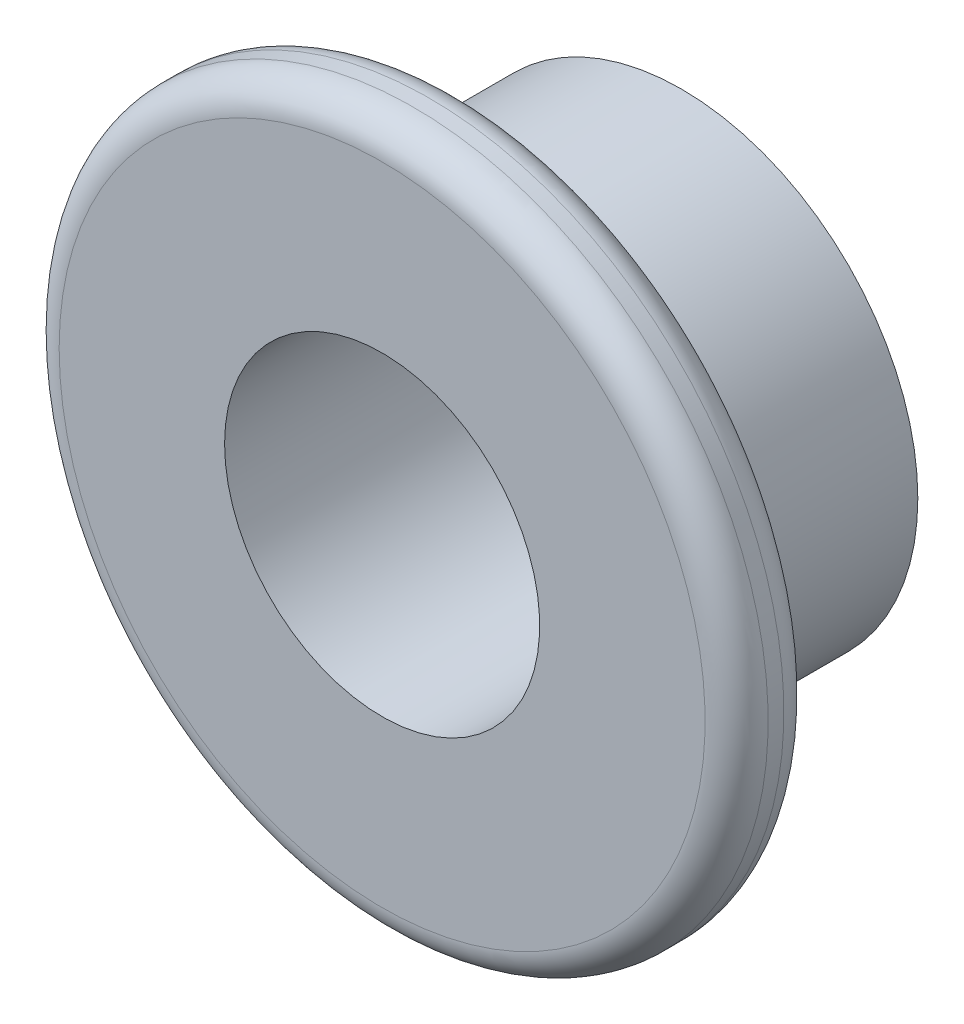
ISO-10303-21;
HEADER;
FILE_DESCRIPTION(('STEP AP214'),'2;1');
FILE_NAME('part.step','',(''),(''),'','','');
FILE_SCHEMA(('AUTOMOTIVE_DESIGN { 1 0 10303 214 1 1 1 1 }'));
ENDSEC;
DATA;
#1=APPLICATION_CONTEXT('core data for automotive mechanical design processes');
#2=APPLICATION_PROTOCOL_DEFINITION('international standard','automotive_design',2000,#1);
#3=PRODUCT_CONTEXT('',#1,'mechanical');
#4=PRODUCT('Part','Part','',(#3));
#5=PRODUCT_RELATED_PRODUCT_CATEGORY('part','',(#4));
#6=PRODUCT_DEFINITION_FORMATION('','',#4);
#7=PRODUCT_DEFINITION_CONTEXT('part definition',#1,'design');
#8=PRODUCT_DEFINITION('design','',#6,#7);
#9=PRODUCT_DEFINITION_SHAPE('','',#8);
#10=(LENGTH_UNIT() NAMED_UNIT(*) SI_UNIT(.MILLI.,.METRE.));
#11=(NAMED_UNIT(*) PLANE_ANGLE_UNIT() SI_UNIT($,.RADIAN.));
#12=(NAMED_UNIT(*) SI_UNIT($,.STERADIAN.) SOLID_ANGLE_UNIT());
#13=UNCERTAINTY_MEASURE_WITH_UNIT(LENGTH_MEASURE(1.E-05),#10,'distance_accuracy_value','');
#14=(GEOMETRIC_REPRESENTATION_CONTEXT(3) GLOBAL_UNCERTAINTY_ASSIGNED_CONTEXT((#13)) GLOBAL_UNIT_ASSIGNED_CONTEXT((#10,
#11,#12)) REPRESENTATION_CONTEXT('',''));
#15=CARTESIAN_POINT('',(0.,0.,0.));
#16=DIRECTION('',(0.,0.,1.));
#17=DIRECTION('',(1.,0.,0.));
#18=AXIS2_PLACEMENT_3D('',#15,#16,#17);
#19=CARTESIAN_POINT('',(0.,0.,5.5));
#20=DIRECTION('',(0.,0.,1.));
#21=DIRECTION('',(1.,0.,0.));
#22=AXIS2_PLACEMENT_3D('',#19,#20,#21);
#23=CYLINDRICAL_SURFACE('',#22,3.);
#24=CARTESIAN_POINT('',(0.,0.,6.3));
#25=DIRECTION('',(0.,0.,1.));
#26=DIRECTION('',(1.,0.,0.));
#27=AXIS2_PLACEMENT_3D('',#24,#25,#26);
#28=CIRCLE('',#27,3.);
#29=CARTESIAN_POINT('',(-2.99999999999994,0.,6.3));
#30=VERTEX_POINT('',#29);
#31=EDGE_CURVE('E69',#30,#30,#28,.T.);
#32=ORIENTED_EDGE('',*,*,#31,.F.);
#33=DIRECTION('',(0.,0.,-1.));
#34=VECTOR('',#33,1.);
#35=CARTESIAN_POINT('',(-2.99999999999994,0.,5.5));
#36=LINE('',#35,#34);
#37=CARTESIAN_POINT('',(-3.,0.,3.5));
#38=VERTEX_POINT('',#37);
#39=EDGE_CURVE('E11',#30,#38,#36,.T.);
#40=ORIENTED_EDGE('',*,*,#39,.T.);
#41=CARTESIAN_POINT('',(0.,0.,3.5));
#42=DIRECTION('',(0.,0.,-1.));
#43=DIRECTION('',(1.,0.,0.));
#44=AXIS2_PLACEMENT_3D('',#41,#42,#43);
#45=CIRCLE('',#44,3.);
#46=EDGE_CURVE('E68',#38,#38,#45,.T.);
#47=ORIENTED_EDGE('',*,*,#46,.F.);
#48=ORIENTED_EDGE('',*,*,#39,.F.);
#49=EDGE_LOOP('',(#32,#40,#47,#48));
#50=FACE_BOUND('',#49,.T.);
#51=ADVANCED_FACE('F16',(#50),#23,.T.);
#52=CARTESIAN_POINT('',(0.,0.,5.5));
#53=DIRECTION('',(0.,0.,1.));
#54=DIRECTION('',(1.,0.,0.));
#55=AXIS2_PLACEMENT_3D('',#52,#53,#54);
#56=CYLINDRICAL_SURFACE('',#55,2.);
#57=CARTESIAN_POINT('',(0.,0.,7.3));
#58=DIRECTION('',(0.,0.,-1.));
#59=DIRECTION('',(1.,0.,0.));
#60=AXIS2_PLACEMENT_3D('',#57,#58,#59);
#61=CIRCLE('',#60,2.);
#62=CARTESIAN_POINT('',(-1.99999999999994,0.,7.3));
#63=VERTEX_POINT('',#62);
#64=EDGE_CURVE('E102',#63,#63,#61,.T.);
#65=ORIENTED_EDGE('',*,*,#64,.F.);
#66=DIRECTION('',(0.,0.,-1.));
#67=VECTOR('',#66,1.);
#68=CARTESIAN_POINT('',(-1.99999999999996,0.,5.5));
#69=LINE('',#68,#67);
#70=CARTESIAN_POINT('',(-2.,0.,3.5));
#71=VERTEX_POINT('',#70);
#72=EDGE_CURVE('E19',#63,#71,#69,.T.);
#73=ORIENTED_EDGE('',*,*,#72,.T.);
#74=CARTESIAN_POINT('',(0.,0.,3.5));
#75=DIRECTION('',(0.,0.,1.));
#76=DIRECTION('',(1.,0.,0.));
#77=AXIS2_PLACEMENT_3D('',#74,#75,#76);
#78=CIRCLE('',#77,2.);
#79=EDGE_CURVE('E73',#71,#71,#78,.T.);
#80=ORIENTED_EDGE('',*,*,#79,.F.);
#81=ORIENTED_EDGE('',*,*,#72,.F.);
#82=EDGE_LOOP('',(#65,#73,#80,#81));
#83=FACE_BOUND('',#82,.T.);
#84=ADVANCED_FACE('F167',(#83),#56,.F.);
#85=CARTESIAN_POINT('',(0.,0.,6.3));
#86=DIRECTION('',(0.,0.,1.));
#87=DIRECTION('',(1.,0.,0.));
#88=AXIS2_PLACEMENT_3D('',#85,#86,#87);
#89=PLANE('',#88);
#90=ORIENTED_EDGE('',*,*,#31,.T.);
#91=EDGE_LOOP('',(#90));
#92=FACE_BOUND('',#91,.T.);
#93=CARTESIAN_POINT('',(0.,0.,6.3));
#94=DIRECTION('',(0.,0.,1.));
#95=DIRECTION('',(1.,0.,0.));
#96=AXIS2_PLACEMENT_3D('',#93,#94,#95);
#97=CIRCLE('',#96,4.1);
#98=CARTESIAN_POINT('',(-4.09999999999995,0.,6.3));
#99=VERTEX_POINT('',#98);
#100=EDGE_CURVE('E44',#99,#99,#97,.T.);
#101=ORIENTED_EDGE('',*,*,#100,.F.);
#102=EDGE_LOOP('',(#101));
#103=FACE_BOUND('',#102,.T.);
#104=ADVANCED_FACE('F159',(#92,#103),#89,.F.);
#105=CARTESIAN_POINT('',(0.,0.,6.7));
#106=DIRECTION('',(0.,0.,1.));
#107=DIRECTION('',(1.,0.,0.));
#108=AXIS2_PLACEMENT_3D('',#105,#106,#107);
#109=TOROIDAL_SURFACE('',#108,4.1,0.4);
#110=CARTESIAN_POINT('',(0.,0.,6.7));
#111=DIRECTION('',(0.,0.,-1.));
#112=DIRECTION('',(1.,0.,0.));
#113=AXIS2_PLACEMENT_3D('',#110,#111,#112);
#114=CIRCLE('',#113,4.5);
#115=CARTESIAN_POINT('',(-4.49999999999994,0.,6.7));
#116=VERTEX_POINT('',#115);
#117=EDGE_CURVE('E89',#116,#116,#114,.T.);
#118=ORIENTED_EDGE('',*,*,#117,.T.);
#119=CARTESIAN_POINT('',(-4.09999999999994,0.,6.7));
#120=DIRECTION('',(0.,-1.,0.));
#121=DIRECTION('',(-1.,0.,0.));
#122=AXIS2_PLACEMENT_3D('',#119,#120,#121);
#123=CIRCLE('',#122,0.4);
#124=EDGE_CURVE('E106',#116,#99,#123,.T.);
#125=ORIENTED_EDGE('',*,*,#124,.T.);
#126=ORIENTED_EDGE('',*,*,#100,.T.);
#127=ORIENTED_EDGE('',*,*,#124,.F.);
#128=EDGE_LOOP('',(#118,#125,#126,#127));
#129=FACE_BOUND('',#128,.T.);
#130=ADVANCED_FACE('F150',(#129),#109,.T.);
#131=CARTESIAN_POINT('',(0.,0.,7.3));
#132=DIRECTION('',(0.,0.,1.));
#133=DIRECTION('',(1.,0.,0.));
#134=AXIS2_PLACEMENT_3D('',#131,#132,#133);
#135=PLANE('',#134);
#136=ORIENTED_EDGE('',*,*,#64,.T.);
#137=EDGE_LOOP('',(#136));
#138=FACE_BOUND('',#137,.T.);
#139=CARTESIAN_POINT('',(0.,0.,7.3));
#140=DIRECTION('',(0.,0.,-1.));
#141=DIRECTION('',(1.,0.,0.));
#142=AXIS2_PLACEMENT_3D('',#139,#140,#141);
#143=CIRCLE('',#142,4.1);
#144=CARTESIAN_POINT('',(-4.09999999999992,0.,7.3));
#145=VERTEX_POINT('',#144);
#146=EDGE_CURVE('E79',#145,#145,#143,.T.);
#147=ORIENTED_EDGE('',*,*,#146,.F.);
#148=EDGE_LOOP('',(#147));
#149=FACE_BOUND('',#148,.T.);
#150=ADVANCED_FACE('F133',(#138,#149),#135,.T.);
#151=CARTESIAN_POINT('',(0.,0.,6.3));
#152=DIRECTION('',(0.,0.,1.));
#153=DIRECTION('',(1.,0.,0.));
#154=AXIS2_PLACEMENT_3D('',#151,#152,#153);
#155=CYLINDRICAL_SURFACE('',#154,4.5);
#156=CARTESIAN_POINT('',(0.,0.,6.9));
#157=DIRECTION('',(0.,0.,1.));
#158=DIRECTION('',(1.,0.,0.));
#159=AXIS2_PLACEMENT_3D('',#156,#157,#158);
#160=CIRCLE('',#159,4.5);
#161=CARTESIAN_POINT('',(-4.49999999999993,0.,6.9));
#162=VERTEX_POINT('',#161);
#163=EDGE_CURVE('E90',#162,#162,#160,.T.);
#164=ORIENTED_EDGE('',*,*,#163,.F.);
#165=DIRECTION('',(0.,0.,-1.));
#166=VECTOR('',#165,1.);
#167=CARTESIAN_POINT('',(-4.49999999999994,0.,6.3));
#168=LINE('',#167,#166);
#169=EDGE_CURVE('E85',#162,#116,#168,.T.);
#170=ORIENTED_EDGE('',*,*,#169,.T.);
#171=ORIENTED_EDGE('',*,*,#117,.F.);
#172=ORIENTED_EDGE('',*,*,#169,.F.);
#173=EDGE_LOOP('',(#164,#170,#171,#172));
#174=FACE_BOUND('',#173,.T.);
#175=ADVANCED_FACE('F129',(#174),#155,.T.);
#176=CARTESIAN_POINT('',(0.,0.,6.9));
#177=DIRECTION('',(0.,0.,1.));
#178=DIRECTION('',(1.,0.,0.));
#179=AXIS2_PLACEMENT_3D('',#176,#177,#178);
#180=TOROIDAL_SURFACE('',#179,4.1,0.4);
#181=ORIENTED_EDGE('',*,*,#146,.T.);
#182=CARTESIAN_POINT('',(-4.09999999999993,0.,6.9));
#183=DIRECTION('',(0.,-1.,0.));
#184=DIRECTION('',(-1.,0.,0.));
#185=AXIS2_PLACEMENT_3D('',#182,#183,#184);
#186=CIRCLE('',#185,0.4);
#187=EDGE_CURVE('E83',#145,#162,#186,.T.);
#188=ORIENTED_EDGE('',*,*,#187,.T.);
#189=ORIENTED_EDGE('',*,*,#163,.T.);
#190=ORIENTED_EDGE('',*,*,#187,.F.);
#191=EDGE_LOOP('',(#181,#188,#189,#190));
#192=FACE_BOUND('',#191,.T.);
#193=ADVANCED_FACE('F122',(#192),#180,.T.);
#194=CARTESIAN_POINT('',(0.,0.,3.5));
#195=DIRECTION('',(0.,0.,1.));
#196=DIRECTION('',(1.,0.,0.));
#197=AXIS2_PLACEMENT_3D('',#194,#195,#196);
#198=PLANE('',#197);
#199=ORIENTED_EDGE('',*,*,#79,.T.);
#200=EDGE_LOOP('',(#199));
#201=FACE_BOUND('',#200,.T.);
#202=ORIENTED_EDGE('',*,*,#46,.T.);
#203=EDGE_LOOP('',(#202));
#204=FACE_BOUND('',#203,.T.);
#205=ADVANCED_FACE('F71',(#201,#204),#198,.F.);
#206=CLOSED_SHELL('',(#51,#84,#104,#130,#150,#175,#193,#205));
#207=MANIFOLD_SOLID_BREP('B1',#206);
#208=ADVANCED_BREP_SHAPE_REPRESENTATION('',(#18,#207),#14);
#209=SHAPE_DEFINITION_REPRESENTATION(#9,#208);
ENDSEC;
END-ISO-10303-21;
